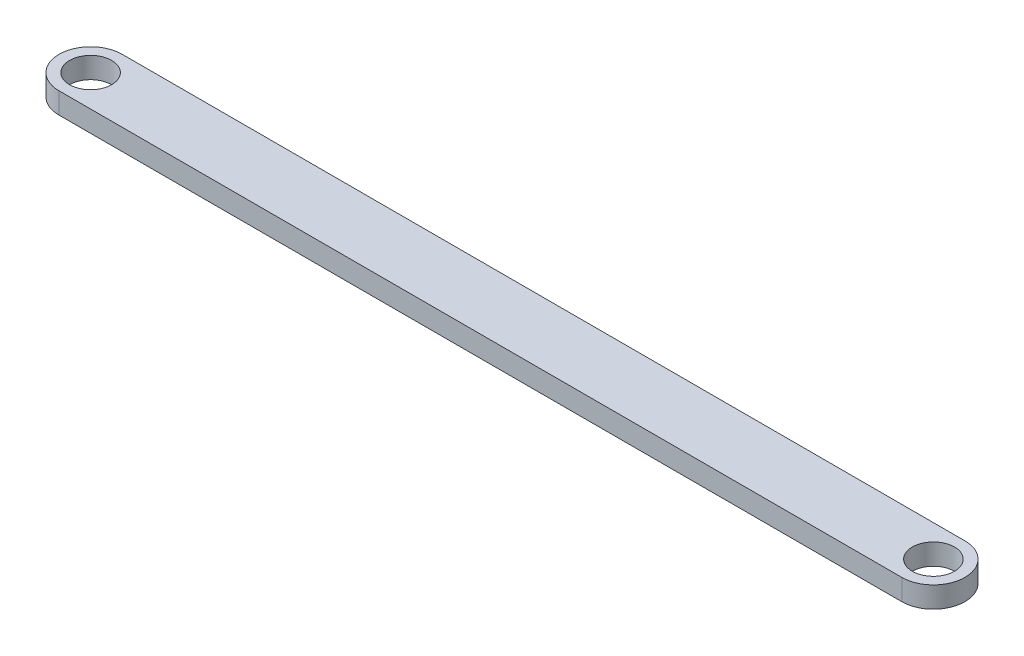
ISO-10303-21;
HEADER;
FILE_DESCRIPTION(('STEP AP214'),'2;1');
FILE_NAME('part.step','',(''),(''),'','','');
FILE_SCHEMA(('AUTOMOTIVE_DESIGN { 1 0 10303 214 1 1 1 1 }'));
ENDSEC;
DATA;
#1=APPLICATION_CONTEXT('core data for automotive mechanical design processes');
#2=APPLICATION_PROTOCOL_DEFINITION('international standard','automotive_design',2000,#1);
#3=PRODUCT_CONTEXT('',#1,'mechanical');
#4=PRODUCT('Part','Part','',(#3));
#5=PRODUCT_RELATED_PRODUCT_CATEGORY('part','',(#4));
#6=PRODUCT_DEFINITION_FORMATION('','',#4);
#7=PRODUCT_DEFINITION_CONTEXT('part definition',#1,'design');
#8=PRODUCT_DEFINITION('design','',#6,#7);
#9=PRODUCT_DEFINITION_SHAPE('','',#8);
#10=(LENGTH_UNIT() NAMED_UNIT(*) SI_UNIT(.MILLI.,.METRE.));
#11=(NAMED_UNIT(*) PLANE_ANGLE_UNIT() SI_UNIT($,.RADIAN.));
#12=(NAMED_UNIT(*) SI_UNIT($,.STERADIAN.) SOLID_ANGLE_UNIT());
#13=UNCERTAINTY_MEASURE_WITH_UNIT(LENGTH_MEASURE(1.E-05),#10,'distance_accuracy_value','');
#14=(GEOMETRIC_REPRESENTATION_CONTEXT(3) GLOBAL_UNCERTAINTY_ASSIGNED_CONTEXT((#13)) GLOBAL_UNIT_ASSIGNED_CONTEXT((#10,
#11,#12)) REPRESENTATION_CONTEXT('',''));
#15=CARTESIAN_POINT('',(0.,0.,0.));
#16=DIRECTION('',(0.,0.,1.));
#17=DIRECTION('',(1.,0.,0.));
#18=AXIS2_PLACEMENT_3D('',#15,#16,#17);
#19=CARTESIAN_POINT('',(-208.,10.,0.));
#20=DIRECTION('',(0.,1.,0.));
#21=DIRECTION('',(0.,0.,1.));
#22=AXIS2_PLACEMENT_3D('',#19,#20,#21);
#23=PLANE('',#22);
#24=CARTESIAN_POINT('',(192.,10.,0.));
#25=DIRECTION('',(0.,1.,0.));
#26=DIRECTION('',(0.,0.,1.));
#27=AXIS2_PLACEMENT_3D('',#24,#25,#26);
#28=CIRCLE('',#27,10.);
#29=CARTESIAN_POINT('',(192.,10.,10.));
#30=VERTEX_POINT('',#29);
#31=EDGE_CURVE('E101',#30,#30,#28,.T.);
#32=ORIENTED_EDGE('',*,*,#31,.F.);
#33=EDGE_LOOP('',(#32));
#34=FACE_BOUND('',#33,.T.);
#35=CARTESIAN_POINT('',(-208.,10.,0.));
#36=DIRECTION('',(0.,1.,0.));
#37=DIRECTION('',(0.,0.,1.));
#38=AXIS2_PLACEMENT_3D('',#35,#36,#37);
#39=CIRCLE('',#38,15.);
#40=CARTESIAN_POINT('',(-208.,10.,-15.));
#41=VERTEX_POINT('',#40);
#42=CARTESIAN_POINT('',(-208.,10.,15.));
#43=VERTEX_POINT('',#42);
#44=EDGE_CURVE('E86',#41,#43,#39,.T.);
#45=ORIENTED_EDGE('',*,*,#44,.T.);
#46=DIRECTION('',(1.,0.,0.));
#47=VECTOR('',#46,1.);
#48=CARTESIAN_POINT('',(-208.,10.,15.));
#49=LINE('',#48,#47);
#50=CARTESIAN_POINT('',(192.,10.,15.));
#51=VERTEX_POINT('',#50);
#52=EDGE_CURVE('E81',#43,#51,#49,.T.);
#53=ORIENTED_EDGE('',*,*,#52,.T.);
#54=CARTESIAN_POINT('',(192.,10.,0.));
#55=DIRECTION('',(0.,1.,0.));
#56=DIRECTION('',(0.,0.,1.));
#57=AXIS2_PLACEMENT_3D('',#54,#55,#56);
#58=CIRCLE('',#57,15.);
#59=CARTESIAN_POINT('',(192.,10.,-15.));
#60=VERTEX_POINT('',#59);
#61=EDGE_CURVE('E84',#51,#60,#58,.T.);
#62=ORIENTED_EDGE('',*,*,#61,.T.);
#63=DIRECTION('',(-1.,0.,0.));
#64=VECTOR('',#63,1.);
#65=CARTESIAN_POINT('',(-208.,10.,-15.));
#66=LINE('',#65,#64);
#67=EDGE_CURVE('E51',#60,#41,#66,.T.);
#68=ORIENTED_EDGE('',*,*,#67,.T.);
#69=EDGE_LOOP('',(#45,#53,#62,#68));
#70=FACE_BOUND('',#69,.T.);
#71=CARTESIAN_POINT('',(-208.,10.,0.));
#72=DIRECTION('',(0.,1.,0.));
#73=DIRECTION('',(0.,0.,1.));
#74=AXIS2_PLACEMENT_3D('',#71,#72,#73);
#75=CIRCLE('',#74,10.);
#76=CARTESIAN_POINT('',(-208.,10.,10.));
#77=VERTEX_POINT('',#76);
#78=EDGE_CURVE('E116',#77,#77,#75,.T.);
#79=ORIENTED_EDGE('',*,*,#78,.F.);
#80=EDGE_LOOP('',(#79));
#81=FACE_BOUND('',#80,.T.);
#82=ADVANCED_FACE('F34',(#34,#70,#81),#23,.T.);
#83=CARTESIAN_POINT('',(-208.,0.,0.));
#84=DIRECTION('',(0.,1.,0.));
#85=DIRECTION('',(0.,0.,1.));
#86=AXIS2_PLACEMENT_3D('',#83,#84,#85);
#87=PLANE('',#86);
#88=CARTESIAN_POINT('',(-208.,0.,0.));
#89=DIRECTION('',(0.,1.,0.));
#90=DIRECTION('',(0.,0.,1.));
#91=AXIS2_PLACEMENT_3D('',#88,#89,#90);
#92=CIRCLE('',#91,15.);
#93=CARTESIAN_POINT('',(-208.,0.,-15.));
#94=VERTEX_POINT('',#93);
#95=CARTESIAN_POINT('',(-208.,0.,15.));
#96=VERTEX_POINT('',#95);
#97=EDGE_CURVE('E98',#94,#96,#92,.T.);
#98=ORIENTED_EDGE('',*,*,#97,.F.);
#99=DIRECTION('',(-1.,0.,0.));
#100=VECTOR('',#99,1.);
#101=CARTESIAN_POINT('',(-208.,0.,-15.));
#102=LINE('',#101,#100);
#103=CARTESIAN_POINT('',(192.,0.,-15.));
#104=VERTEX_POINT('',#103);
#105=EDGE_CURVE('E74',#104,#94,#102,.T.);
#106=ORIENTED_EDGE('',*,*,#105,.F.);
#107=CARTESIAN_POINT('',(192.,0.,0.));
#108=DIRECTION('',(0.,1.,0.));
#109=DIRECTION('',(0.,0.,1.));
#110=AXIS2_PLACEMENT_3D('',#107,#108,#109);
#111=CIRCLE('',#110,15.);
#112=CARTESIAN_POINT('',(192.,0.,15.));
#113=VERTEX_POINT('',#112);
#114=EDGE_CURVE('E68',#113,#104,#111,.T.);
#115=ORIENTED_EDGE('',*,*,#114,.F.);
#116=DIRECTION('',(1.,0.,0.));
#117=VECTOR('',#116,1.);
#118=CARTESIAN_POINT('',(-208.,0.,15.));
#119=LINE('',#118,#117);
#120=EDGE_CURVE('E90',#96,#113,#119,.T.);
#121=ORIENTED_EDGE('',*,*,#120,.F.);
#122=EDGE_LOOP('',(#98,#106,#115,#121));
#123=FACE_BOUND('',#122,.T.);
#124=CARTESIAN_POINT('',(192.,0.,0.));
#125=DIRECTION('',(0.,1.,0.));
#126=DIRECTION('',(0.,0.,1.));
#127=AXIS2_PLACEMENT_3D('',#124,#125,#126);
#128=CIRCLE('',#127,10.);
#129=CARTESIAN_POINT('',(192.,0.,10.));
#130=VERTEX_POINT('',#129);
#131=EDGE_CURVE('E113',#130,#130,#128,.T.);
#132=ORIENTED_EDGE('',*,*,#131,.T.);
#133=EDGE_LOOP('',(#132));
#134=FACE_BOUND('',#133,.T.);
#135=CARTESIAN_POINT('',(-208.,0.,0.));
#136=DIRECTION('',(0.,1.,0.));
#137=DIRECTION('',(0.,0.,1.));
#138=AXIS2_PLACEMENT_3D('',#135,#136,#137);
#139=CIRCLE('',#138,10.);
#140=CARTESIAN_POINT('',(-208.,0.,10.));
#141=VERTEX_POINT('',#140);
#142=EDGE_CURVE('E119',#141,#141,#139,.T.);
#143=ORIENTED_EDGE('',*,*,#142,.T.);
#144=EDGE_LOOP('',(#143));
#145=FACE_BOUND('',#144,.T.);
#146=ADVANCED_FACE('F109',(#123,#134,#145),#87,.F.);
#147=CARTESIAN_POINT('',(-208.,10.,0.));
#148=DIRECTION('',(0.,-1.,0.));
#149=DIRECTION('',(0.,0.,-1.));
#150=AXIS2_PLACEMENT_3D('',#147,#148,#149);
#151=CYLINDRICAL_SURFACE('',#150,15.);
#152=ORIENTED_EDGE('',*,*,#97,.T.);
#153=DIRECTION('',(0.,-1.,0.));
#154=VECTOR('',#153,1.);
#155=CARTESIAN_POINT('',(-208.,10.,15.));
#156=LINE('',#155,#154);
#157=EDGE_CURVE('E11',#43,#96,#156,.T.);
#158=ORIENTED_EDGE('',*,*,#157,.F.);
#159=ORIENTED_EDGE('',*,*,#44,.F.);
#160=DIRECTION('',(0.,-1.,0.));
#161=VECTOR('',#160,1.);
#162=CARTESIAN_POINT('',(-208.,10.,-15.));
#163=LINE('',#162,#161);
#164=EDGE_CURVE('E94',#41,#94,#163,.T.);
#165=ORIENTED_EDGE('',*,*,#164,.T.);
#166=EDGE_LOOP('',(#152,#158,#159,#165));
#167=FACE_BOUND('',#166,.T.);
#168=ADVANCED_FACE('F36',(#167),#151,.T.);
#169=CARTESIAN_POINT('',(-208.,10.,15.));
#170=DIRECTION('',(0.,0.,-1.));
#171=DIRECTION('',(-1.,0.,0.));
#172=AXIS2_PLACEMENT_3D('',#169,#170,#171);
#173=PLANE('',#172);
#174=ORIENTED_EDGE('',*,*,#120,.T.);
#175=DIRECTION('',(0.,-1.,0.));
#176=VECTOR('',#175,1.);
#177=CARTESIAN_POINT('',(192.,10.,15.));
#178=LINE('',#177,#176);
#179=EDGE_CURVE('E43',#51,#113,#178,.T.);
#180=ORIENTED_EDGE('',*,*,#179,.F.);
#181=ORIENTED_EDGE('',*,*,#52,.F.);
#182=ORIENTED_EDGE('',*,*,#157,.T.);
#183=EDGE_LOOP('',(#174,#180,#181,#182));
#184=FACE_BOUND('',#183,.T.);
#185=ADVANCED_FACE('F89',(#184),#173,.F.);
#186=CARTESIAN_POINT('',(192.,10.,0.));
#187=DIRECTION('',(0.,-1.,0.));
#188=DIRECTION('',(0.,0.,-1.));
#189=AXIS2_PLACEMENT_3D('',#186,#187,#188);
#190=CYLINDRICAL_SURFACE('',#189,15.);
#191=ORIENTED_EDGE('',*,*,#114,.T.);
#192=DIRECTION('',(0.,-1.,0.));
#193=VECTOR('',#192,1.);
#194=CARTESIAN_POINT('',(192.,10.,-15.));
#195=LINE('',#194,#193);
#196=EDGE_CURVE('E91',#60,#104,#195,.T.);
#197=ORIENTED_EDGE('',*,*,#196,.F.);
#198=ORIENTED_EDGE('',*,*,#61,.F.);
#199=ORIENTED_EDGE('',*,*,#179,.T.);
#200=EDGE_LOOP('',(#191,#197,#198,#199));
#201=FACE_BOUND('',#200,.T.);
#202=ADVANCED_FACE('F92',(#201),#190,.T.);
#203=CARTESIAN_POINT('',(-208.,10.,-15.));
#204=DIRECTION('',(0.,0.,1.));
#205=DIRECTION('',(1.,0.,0.));
#206=AXIS2_PLACEMENT_3D('',#203,#204,#205);
#207=PLANE('',#206);
#208=ORIENTED_EDGE('',*,*,#105,.T.);
#209=ORIENTED_EDGE('',*,*,#164,.F.);
#210=ORIENTED_EDGE('',*,*,#67,.F.);
#211=ORIENTED_EDGE('',*,*,#196,.T.);
#212=EDGE_LOOP('',(#208,#209,#210,#211));
#213=FACE_BOUND('',#212,.T.);
#214=ADVANCED_FACE('F106',(#213),#207,.F.);
#215=CARTESIAN_POINT('',(192.,10.,0.));
#216=DIRECTION('',(0.,-1.,0.));
#217=DIRECTION('',(0.,0.,-1.));
#218=AXIS2_PLACEMENT_3D('',#215,#216,#217);
#219=CYLINDRICAL_SURFACE('',#218,10.);
#220=ORIENTED_EDGE('',*,*,#31,.T.);
#221=EDGE_LOOP('',(#220));
#222=FACE_BOUND('',#221,.T.);
#223=ORIENTED_EDGE('',*,*,#131,.F.);
#224=EDGE_LOOP('',(#223));
#225=FACE_BOUND('',#224,.T.);
#226=ADVANCED_FACE('F136',(#222,#225),#219,.F.);
#227=CARTESIAN_POINT('',(-208.,10.,0.));
#228=DIRECTION('',(0.,-1.,0.));
#229=DIRECTION('',(0.,0.,-1.));
#230=AXIS2_PLACEMENT_3D('',#227,#228,#229);
#231=CYLINDRICAL_SURFACE('',#230,10.);
#232=ORIENTED_EDGE('',*,*,#78,.T.);
#233=EDGE_LOOP('',(#232));
#234=FACE_BOUND('',#233,.T.);
#235=ORIENTED_EDGE('',*,*,#142,.F.);
#236=EDGE_LOOP('',(#235));
#237=FACE_BOUND('',#236,.T.);
#238=ADVANCED_FACE('F125',(#234,#237),#231,.F.);
#239=CLOSED_SHELL('',(#82,#146,#168,#185,#202,#214,#226,#238));
#240=MANIFOLD_SOLID_BREP('B2',#239);
#241=ADVANCED_BREP_SHAPE_REPRESENTATION('',(#18,#240),#14);
#242=SHAPE_DEFINITION_REPRESENTATION(#9,#241);
ENDSEC;
END-ISO-10303-21;
